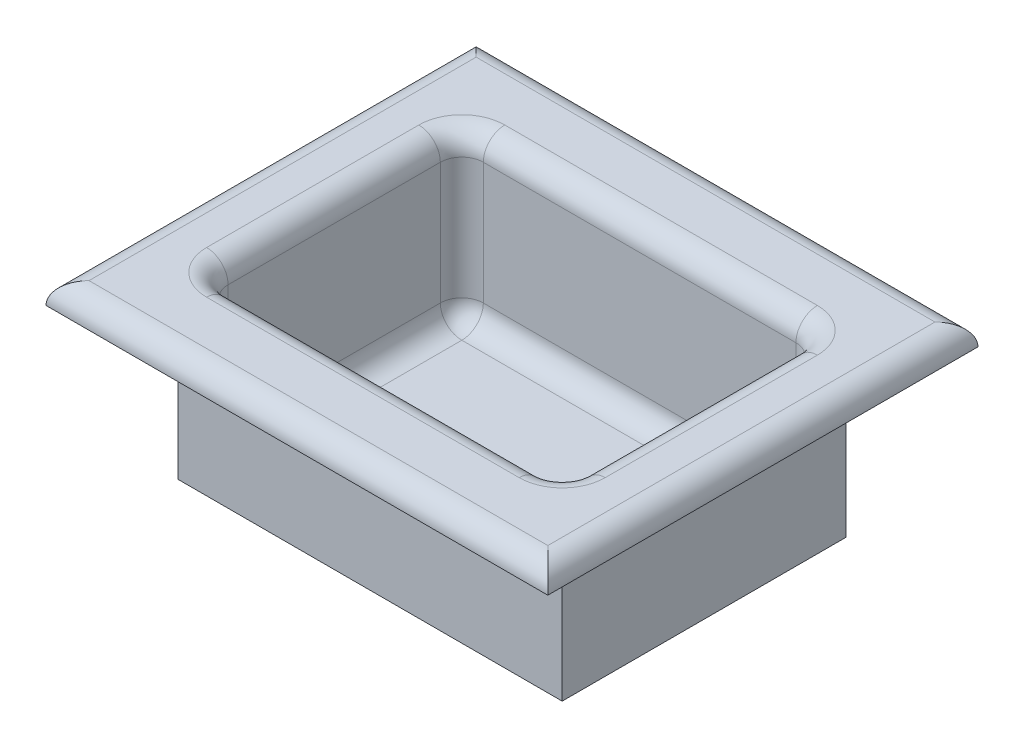
ISO-10303-21;
HEADER;
FILE_DESCRIPTION(('STEP AP214'),'2;1');
FILE_NAME('part.step','',(''),(''),'','','');
FILE_SCHEMA(('AUTOMOTIVE_DESIGN { 1 0 10303 214 1 1 1 1 }'));
ENDSEC;
DATA;
#1=APPLICATION_CONTEXT('core data for automotive mechanical design processes');
#2=APPLICATION_PROTOCOL_DEFINITION('international standard','automotive_design',2000,#1);
#3=PRODUCT_CONTEXT('',#1,'mechanical');
#4=PRODUCT('Part','Part','',(#3));
#5=PRODUCT_RELATED_PRODUCT_CATEGORY('part','',(#4));
#6=PRODUCT_DEFINITION_FORMATION('','',#4);
#7=PRODUCT_DEFINITION_CONTEXT('part definition',#1,'design');
#8=PRODUCT_DEFINITION('design','',#6,#7);
#9=PRODUCT_DEFINITION_SHAPE('','',#8);
#10=(LENGTH_UNIT() NAMED_UNIT(*) SI_UNIT(.MILLI.,.METRE.));
#11=(NAMED_UNIT(*) PLANE_ANGLE_UNIT() SI_UNIT($,.RADIAN.));
#12=(NAMED_UNIT(*) SI_UNIT($,.STERADIAN.) SOLID_ANGLE_UNIT());
#13=UNCERTAINTY_MEASURE_WITH_UNIT(LENGTH_MEASURE(1.E-05),#10,'distance_accuracy_value','');
#14=(GEOMETRIC_REPRESENTATION_CONTEXT(3) GLOBAL_UNCERTAINTY_ASSIGNED_CONTEXT((#13)) GLOBAL_UNIT_ASSIGNED_CONTEXT((#10,
#11,#12)) REPRESENTATION_CONTEXT('',''));
#15=CARTESIAN_POINT('',(0.,0.,0.));
#16=DIRECTION('',(0.,0.,1.));
#17=DIRECTION('',(1.,0.,0.));
#18=AXIS2_PLACEMENT_3D('',#15,#16,#17);
#19=CARTESIAN_POINT('',(-26.8,2.,19.8));
#20=DIRECTION('',(1.,0.,0.));
#21=DIRECTION('',(0.,0.,-1.));
#22=AXIS2_PLACEMENT_3D('',#19,#20,#21);
#23=PLANE('',#22);
#24=DIRECTION('',(0.,0.,1.));
#25=VECTOR('',#24,1.);
#26=CARTESIAN_POINT('',(-26.8,0.,19.8));
#27=LINE('',#26,#25);
#28=CARTESIAN_POINT('',(-26.8,0.,-19.8));
#29=VERTEX_POINT('',#28);
#30=CARTESIAN_POINT('',(-26.8,0.,19.8));
#31=VERTEX_POINT('',#30);
#32=EDGE_CURVE('E227',#29,#31,#27,.T.);
#33=ORIENTED_EDGE('',*,*,#32,.T.);
#34=DIRECTION('',(0.,-1.,0.));
#35=VECTOR('',#34,1.);
#36=CARTESIAN_POINT('',(-26.8,2.,19.8));
#37=LINE('',#36,#35);
#38=CARTESIAN_POINT('',(-26.8,22.,19.8));
#39=VERTEX_POINT('',#38);
#40=EDGE_CURVE('E245',#39,#31,#37,.T.);
#41=ORIENTED_EDGE('',*,*,#40,.F.);
#42=DIRECTION('',(0.,0.,1.));
#43=VECTOR('',#42,1.);
#44=CARTESIAN_POINT('',(-26.8,22.,19.8));
#45=LINE('',#44,#43);
#46=CARTESIAN_POINT('',(-26.8,22.,-19.8));
#47=VERTEX_POINT('',#46);
#48=EDGE_CURVE('E215',#47,#39,#45,.T.);
#49=ORIENTED_EDGE('',*,*,#48,.F.);
#50=DIRECTION('',(0.,-1.,0.));
#51=VECTOR('',#50,1.);
#52=CARTESIAN_POINT('',(-26.8,2.,-19.8));
#53=LINE('',#52,#51);
#54=EDGE_CURVE('E236',#47,#29,#53,.T.);
#55=ORIENTED_EDGE('',*,*,#54,.T.);
#56=EDGE_LOOP('',(#33,#41,#49,#55));
#57=FACE_BOUND('',#56,.T.);
#58=ADVANCED_FACE('F35',(#57),#23,.F.);
#59=CARTESIAN_POINT('',(26.8,2.,19.8));
#60=DIRECTION('',(0.,0.,-1.));
#61=DIRECTION('',(-1.,0.,0.));
#62=AXIS2_PLACEMENT_3D('',#59,#60,#61);
#63=PLANE('',#62);
#64=DIRECTION('',(1.,0.,0.));
#65=VECTOR('',#64,1.);
#66=CARTESIAN_POINT('',(26.8,0.,19.8));
#67=LINE('',#66,#65);
#68=CARTESIAN_POINT('',(26.8,0.,19.8));
#69=VERTEX_POINT('',#68);
#70=EDGE_CURVE('E230',#31,#69,#67,.T.);
#71=ORIENTED_EDGE('',*,*,#70,.T.);
#72=DIRECTION('',(0.,-1.,0.));
#73=VECTOR('',#72,1.);
#74=CARTESIAN_POINT('',(26.8,2.,19.8));
#75=LINE('',#74,#73);
#76=CARTESIAN_POINT('',(26.8,22.,19.8));
#77=VERTEX_POINT('',#76);
#78=EDGE_CURVE('E242',#77,#69,#75,.T.);
#79=ORIENTED_EDGE('',*,*,#78,.F.);
#80=DIRECTION('',(1.,0.,0.));
#81=VECTOR('',#80,1.);
#82=CARTESIAN_POINT('',(26.8,22.,19.8));
#83=LINE('',#82,#81);
#84=EDGE_CURVE('E218',#39,#77,#83,.T.);
#85=ORIENTED_EDGE('',*,*,#84,.F.);
#86=ORIENTED_EDGE('',*,*,#40,.T.);
#87=EDGE_LOOP('',(#71,#79,#85,#86));
#88=FACE_BOUND('',#87,.T.);
#89=ADVANCED_FACE('F404',(#88),#63,.F.);
#90=CARTESIAN_POINT('',(26.8,2.,19.8));
#91=DIRECTION('',(-1.,0.,0.));
#92=DIRECTION('',(0.,0.,1.));
#93=AXIS2_PLACEMENT_3D('',#90,#91,#92);
#94=PLANE('',#93);
#95=DIRECTION('',(0.,0.,-1.));
#96=VECTOR('',#95,1.);
#97=CARTESIAN_POINT('',(26.8,0.,19.8));
#98=LINE('',#97,#96);
#99=CARTESIAN_POINT('',(26.8,0.,-19.8));
#100=VERTEX_POINT('',#99);
#101=EDGE_CURVE('E232',#69,#100,#98,.T.);
#102=ORIENTED_EDGE('',*,*,#101,.T.);
#103=DIRECTION('',(0.,-1.,0.));
#104=VECTOR('',#103,1.);
#105=CARTESIAN_POINT('',(26.8,2.,-19.8));
#106=LINE('',#105,#104);
#107=CARTESIAN_POINT('',(26.8,22.,-19.8));
#108=VERTEX_POINT('',#107);
#109=EDGE_CURVE('E239',#108,#100,#106,.T.);
#110=ORIENTED_EDGE('',*,*,#109,.F.);
#111=DIRECTION('',(0.,0.,-1.));
#112=VECTOR('',#111,1.);
#113=CARTESIAN_POINT('',(26.8,22.,19.8));
#114=LINE('',#113,#112);
#115=EDGE_CURVE('E221',#77,#108,#114,.T.);
#116=ORIENTED_EDGE('',*,*,#115,.F.);
#117=ORIENTED_EDGE('',*,*,#78,.T.);
#118=EDGE_LOOP('',(#102,#110,#116,#117));
#119=FACE_BOUND('',#118,.T.);
#120=ADVANCED_FACE('F410',(#119),#94,.F.);
#121=CARTESIAN_POINT('',(26.8,2.,-19.8));
#122=DIRECTION('',(0.,0.,1.));
#123=DIRECTION('',(1.,0.,0.));
#124=AXIS2_PLACEMENT_3D('',#121,#122,#123);
#125=PLANE('',#124);
#126=DIRECTION('',(-1.,0.,0.));
#127=VECTOR('',#126,1.);
#128=CARTESIAN_POINT('',(26.8,0.,-19.8));
#129=LINE('',#128,#127);
#130=EDGE_CURVE('E234',#100,#29,#129,.T.);
#131=ORIENTED_EDGE('',*,*,#130,.T.);
#132=ORIENTED_EDGE('',*,*,#54,.F.);
#133=DIRECTION('',(-1.,0.,0.));
#134=VECTOR('',#133,1.);
#135=CARTESIAN_POINT('',(26.8,22.,-19.8));
#136=LINE('',#135,#134);
#137=EDGE_CURVE('E224',#108,#47,#136,.T.);
#138=ORIENTED_EDGE('',*,*,#137,.F.);
#139=ORIENTED_EDGE('',*,*,#109,.T.);
#140=EDGE_LOOP('',(#131,#132,#138,#139));
#141=FACE_BOUND('',#140,.T.);
#142=ADVANCED_FACE('F637',(#141),#125,.F.);
#143=CARTESIAN_POINT('',(0.,0.,0.));
#144=DIRECTION('',(0.,1.,0.));
#145=DIRECTION('',(0.,0.,1.));
#146=AXIS2_PLACEMENT_3D('',#143,#144,#145);
#147=PLANE('',#146);
#148=ORIENTED_EDGE('',*,*,#32,.F.);
#149=ORIENTED_EDGE('',*,*,#130,.F.);
#150=ORIENTED_EDGE('',*,*,#101,.F.);
#151=ORIENTED_EDGE('',*,*,#70,.F.);
#152=EDGE_LOOP('',(#148,#149,#150,#151));
#153=FACE_BOUND('',#152,.T.);
#154=ADVANCED_FACE('F401',(#153),#147,.F.);
#155=CARTESIAN_POINT('',(0.,22.,0.));
#156=DIRECTION('',(0.,1.,0.));
#157=DIRECTION('',(0.,0.,1.));
#158=AXIS2_PLACEMENT_3D('',#155,#156,#157);
#159=PLANE('',#158);
#160=DIRECTION('',(0.,0.,1.));
#161=VECTOR('',#160,1.);
#162=CARTESIAN_POINT('',(-35.,22.,30.));
#163=LINE('',#162,#161);
#164=CARTESIAN_POINT('',(-35.,22.,-30.));
#165=VERTEX_POINT('',#164);
#166=CARTESIAN_POINT('',(-35.,22.,30.));
#167=VERTEX_POINT('',#166);
#168=EDGE_CURVE('E199',#165,#167,#163,.T.);
#169=ORIENTED_EDGE('',*,*,#168,.F.);
#170=DIRECTION('',(-1.,0.,0.));
#171=VECTOR('',#170,1.);
#172=CARTESIAN_POINT('',(35.,22.,-30.));
#173=LINE('',#172,#171);
#174=CARTESIAN_POINT('',(35.,22.,-30.));
#175=VERTEX_POINT('',#174);
#176=EDGE_CURVE('E211',#175,#165,#173,.T.);
#177=ORIENTED_EDGE('',*,*,#176,.F.);
#178=DIRECTION('',(0.,0.,-1.));
#179=VECTOR('',#178,1.);
#180=CARTESIAN_POINT('',(35.,22.,30.));
#181=LINE('',#180,#179);
#182=CARTESIAN_POINT('',(35.,22.,30.));
#183=VERTEX_POINT('',#182);
#184=EDGE_CURVE('E209',#183,#175,#181,.T.);
#185=ORIENTED_EDGE('',*,*,#184,.F.);
#186=DIRECTION('',(1.,0.,0.));
#187=VECTOR('',#186,1.);
#188=CARTESIAN_POINT('',(35.,22.,30.));
#189=LINE('',#188,#187);
#190=EDGE_CURVE('E189',#167,#183,#189,.T.);
#191=ORIENTED_EDGE('',*,*,#190,.F.);
#192=EDGE_LOOP('',(#169,#177,#185,#191));
#193=FACE_BOUND('',#192,.T.);
#194=ORIENTED_EDGE('',*,*,#137,.T.);
#195=ORIENTED_EDGE('',*,*,#48,.T.);
#196=ORIENTED_EDGE('',*,*,#84,.T.);
#197=ORIENTED_EDGE('',*,*,#115,.T.);
#198=EDGE_LOOP('',(#194,#195,#196,#197));
#199=FACE_BOUND('',#198,.T.);
#200=ADVANCED_FACE('F206',(#193,#199),#159,.F.);
#201=CARTESIAN_POINT('',(0.,25.,0.));
#202=DIRECTION('',(0.,1.,0.));
#203=DIRECTION('',(0.,0.,1.));
#204=AXIS2_PLACEMENT_3D('',#201,#202,#203);
#205=PLANE('',#204);
#206=CARTESIAN_POINT('',(21.8,25.,-14.8));
#207=DIRECTION('',(0.,1.,0.));
#208=DIRECTION('',(0.,0.,1.));
#209=AXIS2_PLACEMENT_3D('',#206,#207,#208);
#210=CIRCLE('',#209,6.);
#211=CARTESIAN_POINT('',(27.8,25.,-14.8));
#212=VERTEX_POINT('',#211);
#213=CARTESIAN_POINT('',(21.8,25.,-20.8));
#214=VERTEX_POINT('',#213);
#215=EDGE_CURVE('E286',#212,#214,#210,.T.);
#216=ORIENTED_EDGE('',*,*,#215,.F.);
#217=DIRECTION('',(0.,0.,-1.));
#218=VECTOR('',#217,1.);
#219=CARTESIAN_POINT('',(27.8,25.,0.));
#220=LINE('',#219,#218);
#221=CARTESIAN_POINT('',(27.8,25.,14.8));
#222=VERTEX_POINT('',#221);
#223=EDGE_CURVE('E292',#212,#222,#220,.F.);
#224=ORIENTED_EDGE('',*,*,#223,.T.);
#225=CARTESIAN_POINT('',(21.8,25.,14.8));
#226=DIRECTION('',(0.,1.,0.));
#227=DIRECTION('',(0.,0.,1.));
#228=AXIS2_PLACEMENT_3D('',#225,#226,#227);
#229=CIRCLE('',#228,6.);
#230=CARTESIAN_POINT('',(21.8,25.,20.8));
#231=VERTEX_POINT('',#230);
#232=EDGE_CURVE('E289',#231,#222,#229,.T.);
#233=ORIENTED_EDGE('',*,*,#232,.F.);
#234=DIRECTION('',(1.,0.,0.));
#235=VECTOR('',#234,1.);
#236=CARTESIAN_POINT('',(0.,25.,20.8));
#237=LINE('',#236,#235);
#238=CARTESIAN_POINT('',(-21.8,25.,20.8));
#239=VERTEX_POINT('',#238);
#240=EDGE_CURVE('E283',#231,#239,#237,.F.);
#241=ORIENTED_EDGE('',*,*,#240,.T.);
#242=CARTESIAN_POINT('',(-21.8,25.,14.8));
#243=DIRECTION('',(0.,1.,0.));
#244=DIRECTION('',(0.,0.,1.));
#245=AXIS2_PLACEMENT_3D('',#242,#243,#244);
#246=CIRCLE('',#245,6.);
#247=CARTESIAN_POINT('',(-27.8,25.,14.8));
#248=VERTEX_POINT('',#247);
#249=EDGE_CURVE('E280',#248,#239,#246,.T.);
#250=ORIENTED_EDGE('',*,*,#249,.F.);
#251=DIRECTION('',(0.,0.,1.));
#252=VECTOR('',#251,1.);
#253=CARTESIAN_POINT('',(-27.8,25.,0.));
#254=LINE('',#253,#252);
#255=CARTESIAN_POINT('',(-27.8,25.,-14.8));
#256=VERTEX_POINT('',#255);
#257=EDGE_CURVE('E276',#248,#256,#254,.F.);
#258=ORIENTED_EDGE('',*,*,#257,.T.);
#259=CARTESIAN_POINT('',(-21.8,25.,-14.8));
#260=DIRECTION('',(0.,1.,0.));
#261=DIRECTION('',(0.,0.,1.));
#262=AXIS2_PLACEMENT_3D('',#259,#260,#261);
#263=CIRCLE('',#262,6.);
#264=CARTESIAN_POINT('',(-21.8,25.,-20.8));
#265=VERTEX_POINT('',#264);
#266=EDGE_CURVE('E273',#265,#256,#263,.T.);
#267=ORIENTED_EDGE('',*,*,#266,.F.);
#268=DIRECTION('',(-1.,0.,0.));
#269=VECTOR('',#268,1.);
#270=CARTESIAN_POINT('',(0.,25.,-20.8));
#271=LINE('',#270,#269);
#272=EDGE_CURVE('E278',#265,#214,#271,.F.);
#273=ORIENTED_EDGE('',*,*,#272,.T.);
#274=EDGE_LOOP('',(#216,#224,#233,#241,#250,#258,#267,#273));
#275=FACE_BOUND('',#274,.T.);
#276=DIRECTION('',(1.,0.,0.));
#277=VECTOR('',#276,1.);
#278=CARTESIAN_POINT('',(35.,25.,27.));
#279=LINE('',#278,#277);
#280=CARTESIAN_POINT('',(-32.,25.,27.));
#281=VERTEX_POINT('',#280);
#282=CARTESIAN_POINT('',(32.,25.,27.));
#283=VERTEX_POINT('',#282);
#284=EDGE_CURVE('E192',#281,#283,#279,.T.);
#285=ORIENTED_EDGE('',*,*,#284,.T.);
#286=DIRECTION('',(0.,0.,-1.));
#287=VECTOR('',#286,1.);
#288=CARTESIAN_POINT('',(32.,25.,-30.));
#289=LINE('',#288,#287);
#290=CARTESIAN_POINT('',(32.,25.,-27.));
#291=VERTEX_POINT('',#290);
#292=EDGE_CURVE('E271',#283,#291,#289,.T.);
#293=ORIENTED_EDGE('',*,*,#292,.T.);
#294=DIRECTION('',(-1.,0.,0.));
#295=VECTOR('',#294,1.);
#296=CARTESIAN_POINT('',(-35.,25.,-27.));
#297=LINE('',#296,#295);
#298=CARTESIAN_POINT('',(-32.,25.,-27.));
#299=VERTEX_POINT('',#298);
#300=EDGE_CURVE('E268',#291,#299,#297,.T.);
#301=ORIENTED_EDGE('',*,*,#300,.T.);
#302=DIRECTION('',(0.,0.,1.));
#303=VECTOR('',#302,1.);
#304=CARTESIAN_POINT('',(-32.,25.,30.));
#305=LINE('',#304,#303);
#306=EDGE_CURVE('E266',#299,#281,#305,.T.);
#307=ORIENTED_EDGE('',*,*,#306,.T.);
#308=EDGE_LOOP('',(#285,#293,#301,#307));
#309=FACE_BOUND('',#308,.T.);
#310=ADVANCED_FACE('F389',(#275,#309),#205,.T.);
#311=CARTESIAN_POINT('',(0.,2.,0.));
#312=DIRECTION('',(0.,1.,0.));
#313=DIRECTION('',(0.,0.,1.));
#314=AXIS2_PLACEMENT_3D('',#311,#312,#313);
#315=PLANE('',#314);
#316=DIRECTION('',(0.,0.,1.));
#317=VECTOR('',#316,1.);
#318=CARTESIAN_POINT('',(-21.8,2.,17.8));
#319=LINE('',#318,#317);
#320=CARTESIAN_POINT('',(-21.8,2.,-14.8));
#321=VERTEX_POINT('',#320);
#322=CARTESIAN_POINT('',(-21.8,2.,14.8));
#323=VERTEX_POINT('',#322);
#324=EDGE_CURVE('E305',#321,#323,#319,.T.);
#325=ORIENTED_EDGE('',*,*,#324,.T.);
#326=DIRECTION('',(1.,0.,0.));
#327=VECTOR('',#326,1.);
#328=CARTESIAN_POINT('',(24.8,2.,14.8));
#329=LINE('',#328,#327);
#330=CARTESIAN_POINT('',(21.8,2.,14.8));
#331=VERTEX_POINT('',#330);
#332=EDGE_CURVE('E309',#323,#331,#329,.T.);
#333=ORIENTED_EDGE('',*,*,#332,.T.);
#334=DIRECTION('',(0.,0.,-1.));
#335=VECTOR('',#334,1.);
#336=CARTESIAN_POINT('',(21.8,2.,-17.8));
#337=LINE('',#336,#335);
#338=CARTESIAN_POINT('',(21.8,2.,-14.8));
#339=VERTEX_POINT('',#338);
#340=EDGE_CURVE('E307',#331,#339,#337,.T.);
#341=ORIENTED_EDGE('',*,*,#340,.T.);
#342=DIRECTION('',(-1.,0.,0.));
#343=VECTOR('',#342,1.);
#344=CARTESIAN_POINT('',(-24.8,2.,-14.8));
#345=LINE('',#344,#343);
#346=EDGE_CURVE('E303',#339,#321,#345,.T.);
#347=ORIENTED_EDGE('',*,*,#346,.T.);
#348=EDGE_LOOP('',(#325,#333,#341,#347));
#349=FACE_BOUND('',#348,.T.);
#350=ADVANCED_FACE('F391',(#349),#315,.T.);
#351=CARTESIAN_POINT('',(24.8,22.,-17.8));
#352=DIRECTION('',(0.,0.,1.));
#353=DIRECTION('',(1.,0.,0.));
#354=AXIS2_PLACEMENT_3D('',#351,#352,#353);
#355=PLANE('',#354);
#356=DIRECTION('',(0.,-1.,0.));
#357=VECTOR('',#356,1.);
#358=CARTESIAN_POINT('',(-21.8,2.,-17.8));
#359=LINE('',#358,#357);
#360=CARTESIAN_POINT('',(-21.8,22.,-17.8));
#361=VERTEX_POINT('',#360);
#362=CARTESIAN_POINT('',(-21.8,5.,-17.8));
#363=VERTEX_POINT('',#362);
#364=EDGE_CURVE('E55',#361,#363,#359,.T.);
#365=ORIENTED_EDGE('',*,*,#364,.T.);
#366=DIRECTION('',(-1.,0.,0.));
#367=VECTOR('',#366,1.);
#368=CARTESIAN_POINT('',(24.8,5.,-17.8));
#369=LINE('',#368,#367);
#370=CARTESIAN_POINT('',(21.8,5.,-17.8));
#371=VERTEX_POINT('',#370);
#372=EDGE_CURVE('E11',#363,#371,#369,.F.);
#373=ORIENTED_EDGE('',*,*,#372,.T.);
#374=DIRECTION('',(0.,-1.,0.));
#375=VECTOR('',#374,1.);
#376=CARTESIAN_POINT('',(21.8,25.,-17.8));
#377=LINE('',#376,#375);
#378=CARTESIAN_POINT('',(21.8,22.,-17.8));
#379=VERTEX_POINT('',#378);
#380=EDGE_CURVE('E44',#371,#379,#377,.F.);
#381=ORIENTED_EDGE('',*,*,#380,.T.);
#382=DIRECTION('',(-1.,0.,0.));
#383=VECTOR('',#382,1.);
#384=CARTESIAN_POINT('',(24.8,22.,-17.8));
#385=LINE('',#384,#383);
#386=EDGE_CURVE('E312',#379,#361,#385,.T.);
#387=ORIENTED_EDGE('',*,*,#386,.T.);
#388=EDGE_LOOP('',(#365,#373,#381,#387));
#389=FACE_BOUND('',#388,.T.);
#390=ADVANCED_FACE('F398',(#389),#355,.T.);
#391=CARTESIAN_POINT('',(24.8,22.,17.8));
#392=DIRECTION('',(-1.,0.,0.));
#393=DIRECTION('',(0.,0.,1.));
#394=AXIS2_PLACEMENT_3D('',#391,#392,#393);
#395=PLANE('',#394);
#396=DIRECTION('',(0.,-1.,0.));
#397=VECTOR('',#396,1.);
#398=CARTESIAN_POINT('',(24.8,2.,-14.8));
#399=LINE('',#398,#397);
#400=CARTESIAN_POINT('',(24.8,22.,-14.8));
#401=VERTEX_POINT('',#400);
#402=CARTESIAN_POINT('',(24.8,5.,-14.8));
#403=VERTEX_POINT('',#402);
#404=EDGE_CURVE('E259',#401,#403,#399,.T.);
#405=ORIENTED_EDGE('',*,*,#404,.T.);
#406=DIRECTION('',(0.,0.,-1.));
#407=VECTOR('',#406,1.);
#408=CARTESIAN_POINT('',(24.8,5.,17.8));
#409=LINE('',#408,#407);
#410=CARTESIAN_POINT('',(24.8,5.,14.8));
#411=VERTEX_POINT('',#410);
#412=EDGE_CURVE('E264',#403,#411,#409,.F.);
#413=ORIENTED_EDGE('',*,*,#412,.T.);
#414=DIRECTION('',(0.,-1.,0.));
#415=VECTOR('',#414,1.);
#416=CARTESIAN_POINT('',(24.8,25.,14.8));
#417=LINE('',#416,#415);
#418=CARTESIAN_POINT('',(24.8,22.,14.8));
#419=VERTEX_POINT('',#418);
#420=EDGE_CURVE('E261',#411,#419,#417,.F.);
#421=ORIENTED_EDGE('',*,*,#420,.T.);
#422=DIRECTION('',(0.,0.,-1.));
#423=VECTOR('',#422,1.);
#424=CARTESIAN_POINT('',(24.8,22.,17.8));
#425=LINE('',#424,#423);
#426=EDGE_CURVE('E257',#419,#401,#425,.T.);
#427=ORIENTED_EDGE('',*,*,#426,.T.);
#428=EDGE_LOOP('',(#405,#413,#421,#427));
#429=FACE_BOUND('',#428,.T.);
#430=ADVANCED_FACE('F599',(#429),#395,.T.);
#431=CARTESIAN_POINT('',(24.8,22.,17.8));
#432=DIRECTION('',(0.,0.,-1.));
#433=DIRECTION('',(-1.,0.,0.));
#434=AXIS2_PLACEMENT_3D('',#431,#432,#433);
#435=PLANE('',#434);
#436=DIRECTION('',(1.,0.,0.));
#437=VECTOR('',#436,1.);
#438=CARTESIAN_POINT('',(24.8,22.,17.8));
#439=LINE('',#438,#437);
#440=CARTESIAN_POINT('',(-21.8,22.,17.8));
#441=VERTEX_POINT('',#440);
#442=CARTESIAN_POINT('',(21.8,22.,17.8));
#443=VERTEX_POINT('',#442);
#444=EDGE_CURVE('E252',#441,#443,#439,.T.);
#445=ORIENTED_EDGE('',*,*,#444,.T.);
#446=DIRECTION('',(0.,-1.,0.));
#447=VECTOR('',#446,1.);
#448=CARTESIAN_POINT('',(21.8,2.,17.8));
#449=LINE('',#448,#447);
#450=CARTESIAN_POINT('',(21.8,5.,17.8));
#451=VERTEX_POINT('',#450);
#452=EDGE_CURVE('E254',#443,#451,#449,.T.);
#453=ORIENTED_EDGE('',*,*,#452,.T.);
#454=DIRECTION('',(1.,0.,0.));
#455=VECTOR('',#454,1.);
#456=CARTESIAN_POINT('',(-24.8,5.,17.8));
#457=LINE('',#456,#455);
#458=CARTESIAN_POINT('',(-21.8,5.,17.8));
#459=VERTEX_POINT('',#458);
#460=EDGE_CURVE('E248',#451,#459,#457,.F.);
#461=ORIENTED_EDGE('',*,*,#460,.T.);
#462=DIRECTION('',(0.,-1.,0.));
#463=VECTOR('',#462,1.);
#464=CARTESIAN_POINT('',(-21.8,25.,17.8));
#465=LINE('',#464,#463);
#466=EDGE_CURVE('E250',#459,#441,#465,.F.);
#467=ORIENTED_EDGE('',*,*,#466,.T.);
#468=EDGE_LOOP('',(#445,#453,#461,#467));
#469=FACE_BOUND('',#468,.T.);
#470=ADVANCED_FACE('F591',(#469),#435,.T.);
#471=CARTESIAN_POINT('',(-24.8,22.,17.8));
#472=DIRECTION('',(1.,0.,0.));
#473=DIRECTION('',(0.,0.,-1.));
#474=AXIS2_PLACEMENT_3D('',#471,#472,#473);
#475=PLANE('',#474);
#476=DIRECTION('',(0.,-1.,0.));
#477=VECTOR('',#476,1.);
#478=CARTESIAN_POINT('',(-24.8,2.,14.8));
#479=LINE('',#478,#477);
#480=CARTESIAN_POINT('',(-24.8,22.,14.8));
#481=VERTEX_POINT('',#480);
#482=CARTESIAN_POINT('',(-24.8,5.,14.8));
#483=VERTEX_POINT('',#482);
#484=EDGE_CURVE('E298',#481,#483,#479,.T.);
#485=ORIENTED_EDGE('',*,*,#484,.T.);
#486=DIRECTION('',(0.,0.,1.));
#487=VECTOR('',#486,1.);
#488=CARTESIAN_POINT('',(-24.8,5.,-17.8));
#489=LINE('',#488,#487);
#490=CARTESIAN_POINT('',(-24.8,5.,-14.8));
#491=VERTEX_POINT('',#490);
#492=EDGE_CURVE('E301',#483,#491,#489,.F.);
#493=ORIENTED_EDGE('',*,*,#492,.T.);
#494=DIRECTION('',(0.,-1.,0.));
#495=VECTOR('',#494,1.);
#496=CARTESIAN_POINT('',(-24.8,25.,-14.8));
#497=LINE('',#496,#495);
#498=CARTESIAN_POINT('',(-24.8,22.,-14.8));
#499=VERTEX_POINT('',#498);
#500=EDGE_CURVE('E296',#491,#499,#497,.F.);
#501=ORIENTED_EDGE('',*,*,#500,.T.);
#502=DIRECTION('',(0.,0.,1.));
#503=VECTOR('',#502,1.);
#504=CARTESIAN_POINT('',(-24.8,22.,17.8));
#505=LINE('',#504,#503);
#506=EDGE_CURVE('E294',#499,#481,#505,.T.);
#507=ORIENTED_EDGE('',*,*,#506,.T.);
#508=EDGE_LOOP('',(#485,#493,#501,#507));
#509=FACE_BOUND('',#508,.T.);
#510=ADVANCED_FACE('F494',(#509),#475,.T.);
#511=CARTESIAN_POINT('',(-21.8,22.,-14.8));
#512=DIRECTION('',(0.,1.,0.));
#513=DIRECTION('',(0.,0.,1.));
#514=AXIS2_PLACEMENT_3D('',#511,#512,#513);
#515=CYLINDRICAL_SURFACE('',#514,3.);
#516=CARTESIAN_POINT('',(-21.8,22.,-14.8));
#517=DIRECTION('',(0.,1.,0.));
#518=DIRECTION('',(0.,0.,1.));
#519=AXIS2_PLACEMENT_3D('',#516,#517,#518);
#520=CIRCLE('',#519,3.);
#521=EDGE_CURVE('E204',#499,#361,#520,.F.);
#522=ORIENTED_EDGE('',*,*,#521,.F.);
#523=ORIENTED_EDGE('',*,*,#500,.F.);
#524=CARTESIAN_POINT('',(-21.8,5.,-14.8));
#525=DIRECTION('',(0.,1.,0.));
#526=DIRECTION('',(0.,0.,1.));
#527=AXIS2_PLACEMENT_3D('',#524,#525,#526);
#528=CIRCLE('',#527,3.);
#529=EDGE_CURVE('E376',#363,#491,#528,.T.);
#530=ORIENTED_EDGE('',*,*,#529,.F.);
#531=ORIENTED_EDGE('',*,*,#364,.F.);
#532=EDGE_LOOP('',(#522,#523,#530,#531));
#533=FACE_BOUND('',#532,.T.);
#534=ADVANCED_FACE('F490',(#533),#515,.F.);
#535=CARTESIAN_POINT('',(-21.8,22.,-14.8));
#536=DIRECTION('',(0.,1.,0.));
#537=DIRECTION('',(0.,0.,1.));
#538=AXIS2_PLACEMENT_3D('',#535,#536,#537);
#539=TOROIDAL_SURFACE('',#538,6.,3.);
#540=CARTESIAN_POINT('',(-27.8,22.,-14.8));
#541=DIRECTION('',(0.,0.,-1.));
#542=DIRECTION('',(-1.,0.,0.));
#543=AXIS2_PLACEMENT_3D('',#540,#541,#542);
#544=CIRCLE('',#543,3.);
#545=EDGE_CURVE('E370',#499,#256,#544,.F.);
#546=ORIENTED_EDGE('',*,*,#545,.F.);
#547=ORIENTED_EDGE('',*,*,#521,.T.);
#548=CARTESIAN_POINT('',(-21.8,22.,-20.8));
#549=DIRECTION('',(-1.,0.,0.));
#550=DIRECTION('',(0.,0.,1.));
#551=AXIS2_PLACEMENT_3D('',#548,#549,#550);
#552=CIRCLE('',#551,3.);
#553=EDGE_CURVE('E373',#265,#361,#552,.F.);
#554=ORIENTED_EDGE('',*,*,#553,.F.);
#555=ORIENTED_EDGE('',*,*,#266,.T.);
#556=EDGE_LOOP('',(#546,#547,#554,#555));
#557=FACE_BOUND('',#556,.T.);
#558=ADVANCED_FACE('F486',(#557),#539,.T.);
#559=CARTESIAN_POINT('',(-21.8,5.,-14.8));
#560=DIRECTION('',(0.,0.,1.));
#561=DIRECTION('',(1.,0.,0.));
#562=AXIS2_PLACEMENT_3D('',#559,#560,#561);
#563=SPHERICAL_SURFACE('',#562,3.);
#564=CARTESIAN_POINT('',(-21.8,5.,-14.8));
#565=DIRECTION('',(1.,0.,0.));
#566=DIRECTION('',(0.,0.,-1.));
#567=AXIS2_PLACEMENT_3D('',#564,#565,#566);
#568=CIRCLE('',#567,3.);
#569=EDGE_CURVE('E364',#363,#321,#568,.F.);
#570=ORIENTED_EDGE('',*,*,#569,.F.);
#571=ORIENTED_EDGE('',*,*,#529,.T.);
#572=CARTESIAN_POINT('',(-21.8,5.,-14.8));
#573=DIRECTION('',(0.,0.,1.));
#574=DIRECTION('',(1.,0.,0.));
#575=AXIS2_PLACEMENT_3D('',#572,#573,#574);
#576=CIRCLE('',#575,3.);
#577=EDGE_CURVE('E367',#321,#491,#576,.F.);
#578=ORIENTED_EDGE('',*,*,#577,.F.);
#579=EDGE_LOOP('',(#570,#571,#578));
#580=FACE_BOUND('',#579,.T.);
#581=ADVANCED_FACE('F482',(#580),#563,.F.);
#582=CARTESIAN_POINT('',(24.8,22.,-20.8));
#583=DIRECTION('',(-1.,0.,0.));
#584=DIRECTION('',(0.,0.,1.));
#585=AXIS2_PLACEMENT_3D('',#582,#583,#584);
#586=CYLINDRICAL_SURFACE('',#585,3.);
#587=ORIENTED_EDGE('',*,*,#553,.T.);
#588=ORIENTED_EDGE('',*,*,#386,.F.);
#589=CARTESIAN_POINT('',(21.8,22.,-20.8));
#590=DIRECTION('',(1.,0.,0.));
#591=DIRECTION('',(0.,0.,-1.));
#592=AXIS2_PLACEMENT_3D('',#589,#590,#591);
#593=CIRCLE('',#592,3.);
#594=EDGE_CURVE('E359',#214,#379,#593,.T.);
#595=ORIENTED_EDGE('',*,*,#594,.F.);
#596=ORIENTED_EDGE('',*,*,#272,.F.);
#597=EDGE_LOOP('',(#587,#588,#595,#596));
#598=FACE_BOUND('',#597,.T.);
#599=ADVANCED_FACE('F478',(#598),#586,.T.);
#600=CARTESIAN_POINT('',(-27.8,22.,17.8));
#601=DIRECTION('',(0.,0.,1.));
#602=DIRECTION('',(1.,0.,0.));
#603=AXIS2_PLACEMENT_3D('',#600,#601,#602);
#604=CYLINDRICAL_SURFACE('',#603,3.);
#605=ORIENTED_EDGE('',*,*,#545,.T.);
#606=ORIENTED_EDGE('',*,*,#257,.F.);
#607=CARTESIAN_POINT('',(-27.8,22.,14.8));
#608=DIRECTION('',(0.,0.,1.));
#609=DIRECTION('',(1.,0.,0.));
#610=AXIS2_PLACEMENT_3D('',#607,#608,#609);
#611=CIRCLE('',#610,3.);
#612=EDGE_CURVE('E356',#481,#248,#611,.T.);
#613=ORIENTED_EDGE('',*,*,#612,.F.);
#614=ORIENTED_EDGE('',*,*,#506,.F.);
#615=EDGE_LOOP('',(#605,#606,#613,#614));
#616=FACE_BOUND('',#615,.T.);
#617=ADVANCED_FACE('F474',(#616),#604,.T.);
#618=CARTESIAN_POINT('',(-21.8,22.,14.8));
#619=DIRECTION('',(0.,1.,0.));
#620=DIRECTION('',(0.,0.,1.));
#621=AXIS2_PLACEMENT_3D('',#618,#619,#620);
#622=CYLINDRICAL_SURFACE('',#621,3.);
#623=CARTESIAN_POINT('',(-21.8,5.,14.8));
#624=DIRECTION('',(0.,1.,0.));
#625=DIRECTION('',(0.,0.,1.));
#626=AXIS2_PLACEMENT_3D('',#623,#624,#625);
#627=CIRCLE('',#626,3.);
#628=EDGE_CURVE('E350',#483,#459,#627,.T.);
#629=ORIENTED_EDGE('',*,*,#628,.F.);
#630=ORIENTED_EDGE('',*,*,#484,.F.);
#631=CARTESIAN_POINT('',(-21.8,22.,14.8));
#632=DIRECTION('',(0.,1.,0.));
#633=DIRECTION('',(0.,0.,1.));
#634=AXIS2_PLACEMENT_3D('',#631,#632,#633);
#635=CIRCLE('',#634,3.);
#636=EDGE_CURVE('E353',#441,#481,#635,.F.);
#637=ORIENTED_EDGE('',*,*,#636,.F.);
#638=ORIENTED_EDGE('',*,*,#466,.F.);
#639=EDGE_LOOP('',(#629,#630,#637,#638));
#640=FACE_BOUND('',#639,.T.);
#641=ADVANCED_FACE('F470',(#640),#622,.F.);
#642=CARTESIAN_POINT('',(-21.8,5.,0.));
#643=DIRECTION('',(0.,0.,-1.));
#644=DIRECTION('',(-1.,0.,0.));
#645=AXIS2_PLACEMENT_3D('',#642,#643,#644);
#646=CYLINDRICAL_SURFACE('',#645,3.);
#647=ORIENTED_EDGE('',*,*,#577,.T.);
#648=ORIENTED_EDGE('',*,*,#492,.F.);
#649=CARTESIAN_POINT('',(-21.8,5.,14.8));
#650=DIRECTION('',(0.,0.,-1.));
#651=DIRECTION('',(-1.,0.,0.));
#652=AXIS2_PLACEMENT_3D('',#649,#650,#651);
#653=CIRCLE('',#652,3.);
#654=EDGE_CURVE('E348',#323,#483,#653,.T.);
#655=ORIENTED_EDGE('',*,*,#654,.F.);
#656=ORIENTED_EDGE('',*,*,#324,.F.);
#657=EDGE_LOOP('',(#647,#648,#655,#656));
#658=FACE_BOUND('',#657,.T.);
#659=ADVANCED_FACE('F466',(#658),#646,.F.);
#660=CARTESIAN_POINT('',(0.,5.,-14.8));
#661=DIRECTION('',(1.,0.,0.));
#662=DIRECTION('',(0.,0.,-1.));
#663=AXIS2_PLACEMENT_3D('',#660,#661,#662);
#664=CYLINDRICAL_SURFACE('',#663,3.);
#665=ORIENTED_EDGE('',*,*,#569,.T.);
#666=ORIENTED_EDGE('',*,*,#346,.F.);
#667=CARTESIAN_POINT('',(21.8,5.,-14.8));
#668=DIRECTION('',(-1.,0.,0.));
#669=DIRECTION('',(0.,0.,1.));
#670=AXIS2_PLACEMENT_3D('',#667,#668,#669);
#671=CIRCLE('',#670,3.);
#672=EDGE_CURVE('E345',#371,#339,#671,.T.);
#673=ORIENTED_EDGE('',*,*,#672,.F.);
#674=ORIENTED_EDGE('',*,*,#372,.F.);
#675=EDGE_LOOP('',(#665,#666,#673,#674));
#676=FACE_BOUND('',#675,.T.);
#677=ADVANCED_FACE('F462',(#676),#664,.F.);
#678=CARTESIAN_POINT('',(21.8,22.,-14.8));
#679=DIRECTION('',(0.,1.,0.));
#680=DIRECTION('',(0.,0.,1.));
#681=AXIS2_PLACEMENT_3D('',#678,#679,#680);
#682=CYLINDRICAL_SURFACE('',#681,3.);
#683=CARTESIAN_POINT('',(21.8,22.,-14.8));
#684=DIRECTION('',(0.,1.,0.));
#685=DIRECTION('',(0.,0.,1.));
#686=AXIS2_PLACEMENT_3D('',#683,#684,#685);
#687=CIRCLE('',#686,3.);
#688=EDGE_CURVE('E361',#379,#401,#687,.F.);
#689=ORIENTED_EDGE('',*,*,#688,.F.);
#690=ORIENTED_EDGE('',*,*,#380,.F.);
#691=CARTESIAN_POINT('',(21.8,5.,-14.8));
#692=DIRECTION('',(0.,1.,0.));
#693=DIRECTION('',(0.,0.,1.));
#694=AXIS2_PLACEMENT_3D('',#691,#692,#693);
#695=CIRCLE('',#694,3.);
#696=EDGE_CURVE('E342',#403,#371,#695,.T.);
#697=ORIENTED_EDGE('',*,*,#696,.F.);
#698=ORIENTED_EDGE('',*,*,#404,.F.);
#699=EDGE_LOOP('',(#689,#690,#697,#698));
#700=FACE_BOUND('',#699,.T.);
#701=ADVANCED_FACE('F458',(#700),#682,.F.);
#702=CARTESIAN_POINT('',(21.8,22.,-14.8));
#703=DIRECTION('',(0.,1.,0.));
#704=DIRECTION('',(0.,0.,1.));
#705=AXIS2_PLACEMENT_3D('',#702,#703,#704);
#706=TOROIDAL_SURFACE('',#705,6.,3.);
#707=ORIENTED_EDGE('',*,*,#594,.T.);
#708=ORIENTED_EDGE('',*,*,#688,.T.);
#709=CARTESIAN_POINT('',(27.8,22.,-14.8));
#710=DIRECTION('',(0.,0.,-1.));
#711=DIRECTION('',(-1.,0.,0.));
#712=AXIS2_PLACEMENT_3D('',#709,#710,#711);
#713=CIRCLE('',#712,3.);
#714=EDGE_CURVE('E339',#212,#401,#713,.F.);
#715=ORIENTED_EDGE('',*,*,#714,.F.);
#716=ORIENTED_EDGE('',*,*,#215,.T.);
#717=EDGE_LOOP('',(#707,#708,#715,#716));
#718=FACE_BOUND('',#717,.T.);
#719=ADVANCED_FACE('F454',(#718),#706,.T.);
#720=CARTESIAN_POINT('',(-21.8,22.,14.8));
#721=DIRECTION('',(0.,1.,0.));
#722=DIRECTION('',(0.,0.,1.));
#723=AXIS2_PLACEMENT_3D('',#720,#721,#722);
#724=TOROIDAL_SURFACE('',#723,6.,3.);
#725=ORIENTED_EDGE('',*,*,#612,.T.);
#726=ORIENTED_EDGE('',*,*,#249,.T.);
#727=CARTESIAN_POINT('',(-21.8,22.,20.8));
#728=DIRECTION('',(-1.,0.,0.));
#729=DIRECTION('',(0.,0.,1.));
#730=AXIS2_PLACEMENT_3D('',#727,#728,#729);
#731=CIRCLE('',#730,3.);
#732=EDGE_CURVE('E337',#441,#239,#731,.F.);
#733=ORIENTED_EDGE('',*,*,#732,.F.);
#734=ORIENTED_EDGE('',*,*,#636,.T.);
#735=EDGE_LOOP('',(#725,#726,#733,#734));
#736=FACE_BOUND('',#735,.T.);
#737=ADVANCED_FACE('F450',(#736),#724,.T.);
#738=CARTESIAN_POINT('',(-21.8,5.,14.8));
#739=DIRECTION('',(0.,0.,1.));
#740=DIRECTION('',(1.,0.,0.));
#741=AXIS2_PLACEMENT_3D('',#738,#739,#740);
#742=SPHERICAL_SURFACE('',#741,3.);
#743=ORIENTED_EDGE('',*,*,#654,.T.);
#744=ORIENTED_EDGE('',*,*,#628,.T.);
#745=CARTESIAN_POINT('',(-21.8,5.,14.8));
#746=DIRECTION('',(1.,0.,0.));
#747=DIRECTION('',(0.,0.,-1.));
#748=AXIS2_PLACEMENT_3D('',#745,#746,#747);
#749=CIRCLE('',#748,3.);
#750=EDGE_CURVE('E334',#323,#459,#749,.F.);
#751=ORIENTED_EDGE('',*,*,#750,.F.);
#752=EDGE_LOOP('',(#743,#744,#751));
#753=FACE_BOUND('',#752,.T.);
#754=ADVANCED_FACE('F446',(#753),#742,.F.);
#755=CARTESIAN_POINT('',(21.8,5.,-14.8));
#756=DIRECTION('',(0.,0.,1.));
#757=DIRECTION('',(1.,0.,0.));
#758=AXIS2_PLACEMENT_3D('',#755,#756,#757);
#759=SPHERICAL_SURFACE('',#758,3.);
#760=ORIENTED_EDGE('',*,*,#696,.T.);
#761=ORIENTED_EDGE('',*,*,#672,.T.);
#762=CARTESIAN_POINT('',(21.8,5.,-14.8));
#763=DIRECTION('',(0.,0.,1.));
#764=DIRECTION('',(1.,0.,0.));
#765=AXIS2_PLACEMENT_3D('',#762,#763,#764);
#766=CIRCLE('',#765,3.);
#767=EDGE_CURVE('E331',#403,#339,#766,.F.);
#768=ORIENTED_EDGE('',*,*,#767,.F.);
#769=EDGE_LOOP('',(#760,#761,#768));
#770=FACE_BOUND('',#769,.T.);
#771=ADVANCED_FACE('F442',(#770),#759,.F.);
#772=CARTESIAN_POINT('',(27.8,22.,17.8));
#773=DIRECTION('',(0.,0.,-1.));
#774=DIRECTION('',(-1.,0.,0.));
#775=AXIS2_PLACEMENT_3D('',#772,#773,#774);
#776=CYLINDRICAL_SURFACE('',#775,3.);
#777=ORIENTED_EDGE('',*,*,#714,.T.);
#778=ORIENTED_EDGE('',*,*,#426,.F.);
#779=CARTESIAN_POINT('',(27.8,22.,14.8));
#780=DIRECTION('',(0.,0.,1.));
#781=DIRECTION('',(1.,0.,0.));
#782=AXIS2_PLACEMENT_3D('',#779,#780,#781);
#783=CIRCLE('',#782,3.);
#784=EDGE_CURVE('E328',#222,#419,#783,.T.);
#785=ORIENTED_EDGE('',*,*,#784,.F.);
#786=ORIENTED_EDGE('',*,*,#223,.F.);
#787=EDGE_LOOP('',(#777,#778,#785,#786));
#788=FACE_BOUND('',#787,.T.);
#789=ADVANCED_FACE('F438',(#788),#776,.T.);
#790=CARTESIAN_POINT('',(24.8,22.,20.8));
#791=DIRECTION('',(1.,0.,0.));
#792=DIRECTION('',(0.,0.,-1.));
#793=AXIS2_PLACEMENT_3D('',#790,#791,#792);
#794=CYLINDRICAL_SURFACE('',#793,3.);
#795=ORIENTED_EDGE('',*,*,#732,.T.);
#796=ORIENTED_EDGE('',*,*,#240,.F.);
#797=CARTESIAN_POINT('',(21.8,22.,20.8));
#798=DIRECTION('',(1.,0.,0.));
#799=DIRECTION('',(0.,0.,-1.));
#800=AXIS2_PLACEMENT_3D('',#797,#798,#799);
#801=CIRCLE('',#800,3.);
#802=EDGE_CURVE('E325',#443,#231,#801,.T.);
#803=ORIENTED_EDGE('',*,*,#802,.F.);
#804=ORIENTED_EDGE('',*,*,#444,.F.);
#805=EDGE_LOOP('',(#795,#796,#803,#804));
#806=FACE_BOUND('',#805,.T.);
#807=ADVANCED_FACE('F434',(#806),#794,.T.);
#808=CARTESIAN_POINT('',(0.,5.,14.8));
#809=DIRECTION('',(-1.,0.,0.));
#810=DIRECTION('',(0.,0.,1.));
#811=AXIS2_PLACEMENT_3D('',#808,#809,#810);
#812=CYLINDRICAL_SURFACE('',#811,3.);
#813=ORIENTED_EDGE('',*,*,#750,.T.);
#814=ORIENTED_EDGE('',*,*,#460,.F.);
#815=CARTESIAN_POINT('',(21.8,5.,14.8));
#816=DIRECTION('',(-1.,0.,0.));
#817=DIRECTION('',(0.,0.,1.));
#818=AXIS2_PLACEMENT_3D('',#815,#816,#817);
#819=CIRCLE('',#818,3.);
#820=EDGE_CURVE('E322',#331,#451,#819,.T.);
#821=ORIENTED_EDGE('',*,*,#820,.F.);
#822=ORIENTED_EDGE('',*,*,#332,.F.);
#823=EDGE_LOOP('',(#813,#814,#821,#822));
#824=FACE_BOUND('',#823,.T.);
#825=ADVANCED_FACE('F430',(#824),#812,.F.);
#826=CARTESIAN_POINT('',(21.8,5.,0.));
#827=DIRECTION('',(0.,0.,1.));
#828=DIRECTION('',(1.,0.,0.));
#829=AXIS2_PLACEMENT_3D('',#826,#827,#828);
#830=CYLINDRICAL_SURFACE('',#829,3.);
#831=ORIENTED_EDGE('',*,*,#767,.T.);
#832=ORIENTED_EDGE('',*,*,#340,.F.);
#833=CARTESIAN_POINT('',(21.8,5.,14.8));
#834=DIRECTION('',(0.,0.,-1.));
#835=DIRECTION('',(-1.,0.,0.));
#836=AXIS2_PLACEMENT_3D('',#833,#834,#835);
#837=CIRCLE('',#836,3.);
#838=EDGE_CURVE('E320',#411,#331,#837,.T.);
#839=ORIENTED_EDGE('',*,*,#838,.F.);
#840=ORIENTED_EDGE('',*,*,#412,.F.);
#841=EDGE_LOOP('',(#831,#832,#839,#840));
#842=FACE_BOUND('',#841,.T.);
#843=ADVANCED_FACE('F426',(#842),#830,.F.);
#844=CARTESIAN_POINT('',(21.8,22.,14.8));
#845=DIRECTION('',(0.,1.,0.));
#846=DIRECTION('',(0.,0.,1.));
#847=AXIS2_PLACEMENT_3D('',#844,#845,#846);
#848=TOROIDAL_SURFACE('',#847,6.,3.);
#849=ORIENTED_EDGE('',*,*,#232,.T.);
#850=ORIENTED_EDGE('',*,*,#784,.T.);
#851=CARTESIAN_POINT('',(21.8,22.,14.8));
#852=DIRECTION('',(0.,1.,0.));
#853=DIRECTION('',(0.,0.,1.));
#854=AXIS2_PLACEMENT_3D('',#851,#852,#853);
#855=CIRCLE('',#854,3.);
#856=EDGE_CURVE('E318',#443,#419,#855,.T.);
#857=ORIENTED_EDGE('',*,*,#856,.F.);
#858=ORIENTED_EDGE('',*,*,#802,.T.);
#859=EDGE_LOOP('',(#849,#850,#857,#858));
#860=FACE_BOUND('',#859,.T.);
#861=ADVANCED_FACE('F422',(#860),#848,.T.);
#862=CARTESIAN_POINT('',(21.8,5.,14.8));
#863=DIRECTION('',(0.,0.,1.));
#864=DIRECTION('',(1.,0.,0.));
#865=AXIS2_PLACEMENT_3D('',#862,#863,#864);
#866=SPHERICAL_SURFACE('',#865,3.);
#867=ORIENTED_EDGE('',*,*,#838,.T.);
#868=ORIENTED_EDGE('',*,*,#820,.T.);
#869=CARTESIAN_POINT('',(21.8,5.,14.8));
#870=DIRECTION('',(0.,1.,0.));
#871=DIRECTION('',(0.,0.,1.));
#872=AXIS2_PLACEMENT_3D('',#869,#870,#871);
#873=CIRCLE('',#872,3.);
#874=EDGE_CURVE('E316',#411,#451,#873,.F.);
#875=ORIENTED_EDGE('',*,*,#874,.F.);
#876=EDGE_LOOP('',(#867,#868,#875));
#877=FACE_BOUND('',#876,.T.);
#878=ADVANCED_FACE('F418',(#877),#866,.F.);
#879=CARTESIAN_POINT('',(21.8,22.,14.8));
#880=DIRECTION('',(0.,1.,0.));
#881=DIRECTION('',(0.,0.,1.));
#882=AXIS2_PLACEMENT_3D('',#879,#880,#881);
#883=CYLINDRICAL_SURFACE('',#882,3.);
#884=ORIENTED_EDGE('',*,*,#856,.T.);
#885=ORIENTED_EDGE('',*,*,#420,.F.);
#886=ORIENTED_EDGE('',*,*,#874,.T.);
#887=ORIENTED_EDGE('',*,*,#452,.F.);
#888=EDGE_LOOP('',(#884,#885,#886,#887));
#889=FACE_BOUND('',#888,.T.);
#890=ADVANCED_FACE('F415',(#889),#883,.F.);
#891=CARTESIAN_POINT('',(0.,22.,-27.));
#892=DIRECTION('',(1.,0.,0.));
#893=DIRECTION('',(0.,0.,-1.));
#894=AXIS2_PLACEMENT_3D('',#891,#892,#893);
#895=CYLINDRICAL_SURFACE('',#894,3.);
#896=CARTESIAN_POINT('',(32.,22.,-27.));
#897=DIRECTION('',(0.707106781186548,0.,0.707106781186547));
#898=DIRECTION('',(-0.707106781186547,0.,0.707106781186547));
#899=AXIS2_PLACEMENT_3D('',#896,#897,#898);
#900=ELLIPSE('',#899,4.24264068711929,3.);
#901=EDGE_CURVE('E195',#175,#291,#900,.T.);
#902=ORIENTED_EDGE('',*,*,#901,.F.);
#903=ORIENTED_EDGE('',*,*,#176,.T.);
#904=CARTESIAN_POINT('',(-32.,22.,-27.));
#905=DIRECTION('',(0.707106781186547,0.,-0.707106781186547));
#906=DIRECTION('',(-0.707106781186548,0.,-0.707106781186547));
#907=AXIS2_PLACEMENT_3D('',#904,#905,#906);
#908=ELLIPSE('',#907,4.24264068711928,3.);
#909=EDGE_CURVE('E39',#299,#165,#908,.F.);
#910=ORIENTED_EDGE('',*,*,#909,.F.);
#911=ORIENTED_EDGE('',*,*,#300,.F.);
#912=EDGE_LOOP('',(#902,#903,#910,#911));
#913=FACE_BOUND('',#912,.T.);
#914=ADVANCED_FACE('F37',(#913),#895,.T.);
#915=CARTESIAN_POINT('',(-32.,22.,0.));
#916=DIRECTION('',(0.,0.,-1.));
#917=DIRECTION('',(-1.,0.,0.));
#918=AXIS2_PLACEMENT_3D('',#915,#916,#917);
#919=CYLINDRICAL_SURFACE('',#918,3.);
#920=ORIENTED_EDGE('',*,*,#909,.T.);
#921=ORIENTED_EDGE('',*,*,#168,.T.);
#922=CARTESIAN_POINT('',(-32.,22.,27.));
#923=DIRECTION('',(-0.707106781186548,0.,-0.707106781186547));
#924=DIRECTION('',(0.707106781186547,0.,-0.707106781186547));
#925=AXIS2_PLACEMENT_3D('',#922,#923,#924);
#926=ELLIPSE('',#925,4.24264068711929,3.);
#927=EDGE_CURVE('E185',#281,#167,#926,.F.);
#928=ORIENTED_EDGE('',*,*,#927,.F.);
#929=ORIENTED_EDGE('',*,*,#306,.F.);
#930=EDGE_LOOP('',(#920,#921,#928,#929));
#931=FACE_BOUND('',#930,.T.);
#932=ADVANCED_FACE('F200',(#931),#919,.T.);
#933=CARTESIAN_POINT('',(32.,22.,0.));
#934=DIRECTION('',(0.,0.,1.));
#935=DIRECTION('',(1.,0.,0.));
#936=AXIS2_PLACEMENT_3D('',#933,#934,#935);
#937=CYLINDRICAL_SURFACE('',#936,3.);
#938=ORIENTED_EDGE('',*,*,#901,.T.);
#939=ORIENTED_EDGE('',*,*,#292,.F.);
#940=CARTESIAN_POINT('',(32.,22.,27.));
#941=DIRECTION('',(-0.707106781186547,0.,0.707106781186547));
#942=DIRECTION('',(0.707106781186548,0.,0.707106781186547));
#943=AXIS2_PLACEMENT_3D('',#940,#941,#942);
#944=ELLIPSE('',#943,4.24264068711928,3.);
#945=EDGE_CURVE('E196',#183,#283,#944,.T.);
#946=ORIENTED_EDGE('',*,*,#945,.F.);
#947=ORIENTED_EDGE('',*,*,#184,.T.);
#948=EDGE_LOOP('',(#938,#939,#946,#947));
#949=FACE_BOUND('',#948,.T.);
#950=ADVANCED_FACE('F385',(#949),#937,.T.);
#951=CARTESIAN_POINT('',(0.,22.,27.));
#952=DIRECTION('',(-1.,0.,0.));
#953=DIRECTION('',(0.,0.,1.));
#954=AXIS2_PLACEMENT_3D('',#951,#952,#953);
#955=CYLINDRICAL_SURFACE('',#954,3.);
#956=ORIENTED_EDGE('',*,*,#927,.T.);
#957=ORIENTED_EDGE('',*,*,#190,.T.);
#958=ORIENTED_EDGE('',*,*,#945,.T.);
#959=ORIENTED_EDGE('',*,*,#284,.F.);
#960=EDGE_LOOP('',(#956,#957,#958,#959));
#961=FACE_BOUND('',#960,.T.);
#962=ADVANCED_FACE('F187',(#961),#955,.T.);
#963=CLOSED_SHELL('',(#58,#89,#120,#142,#154,#200,#310,#350,#390,#430,#470,#510,#534,#558,#581,
#599,#617,#641,#659,#677,#701,#719,#737,#754,#771,#789,#807,#825,#843,#861,#878,#890,#914,#932,
#950,#962));
#964=MANIFOLD_SOLID_BREP('B2',#963);
#965=ADVANCED_BREP_SHAPE_REPRESENTATION('',(#18,#964),#14);
#966=SHAPE_DEFINITION_REPRESENTATION(#9,#965);
ENDSEC;
END-ISO-10303-21;
